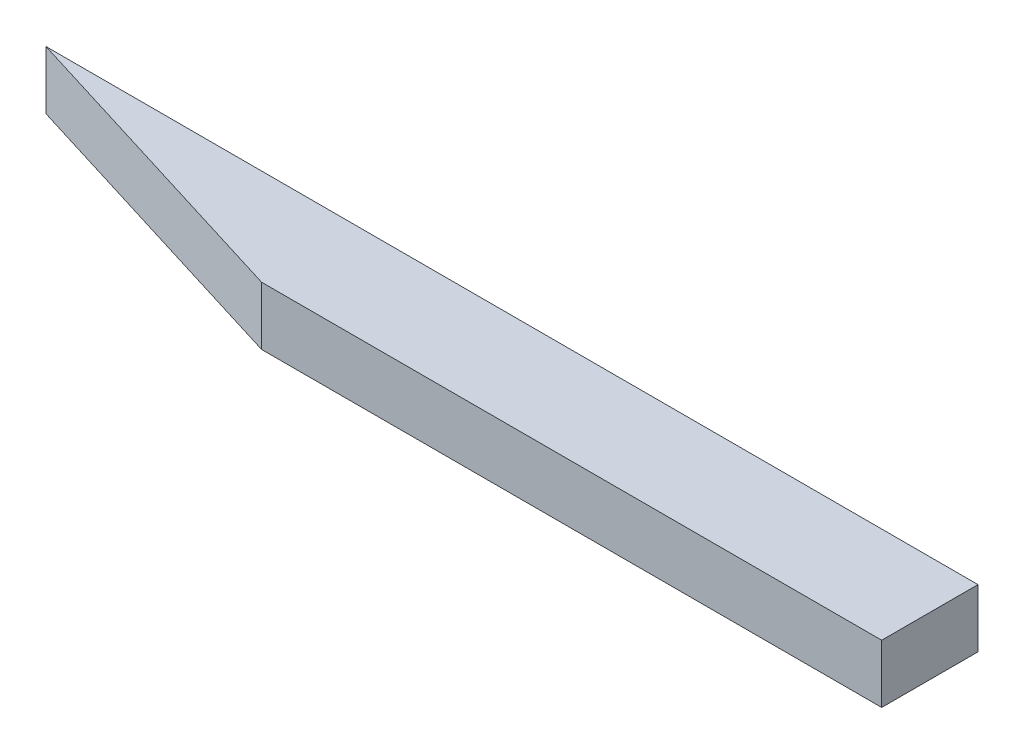
ISO-10303-21;
HEADER;
FILE_DESCRIPTION(('STEP AP214'),'2;1');
FILE_NAME('part.step','',(''),(''),'','','');
FILE_SCHEMA(('AUTOMOTIVE_DESIGN { 1 0 10303 214 1 1 1 1 }'));
ENDSEC;
DATA;
#1=APPLICATION_CONTEXT('core data for automotive mechanical design processes');
#2=APPLICATION_PROTOCOL_DEFINITION('international standard','automotive_design',2000,#1);
#3=PRODUCT_CONTEXT('',#1,'mechanical');
#4=PRODUCT('Part','Part','',(#3));
#5=PRODUCT_RELATED_PRODUCT_CATEGORY('part','',(#4));
#6=PRODUCT_DEFINITION_FORMATION('','',#4);
#7=PRODUCT_DEFINITION_CONTEXT('part definition',#1,'design');
#8=PRODUCT_DEFINITION('design','',#6,#7);
#9=PRODUCT_DEFINITION_SHAPE('','',#8);
#10=(LENGTH_UNIT() NAMED_UNIT(*) SI_UNIT(.MILLI.,.METRE.));
#11=(NAMED_UNIT(*) PLANE_ANGLE_UNIT() SI_UNIT($,.RADIAN.));
#12=(NAMED_UNIT(*) SI_UNIT($,.STERADIAN.) SOLID_ANGLE_UNIT());
#13=UNCERTAINTY_MEASURE_WITH_UNIT(LENGTH_MEASURE(1.E-05),#10,'distance_accuracy_value','');
#14=(GEOMETRIC_REPRESENTATION_CONTEXT(3) GLOBAL_UNCERTAINTY_ASSIGNED_CONTEXT((#13)) GLOBAL_UNIT_ASSIGNED_CONTEXT((#10,
#11,#12)) REPRESENTATION_CONTEXT('',''));
#15=CARTESIAN_POINT('',(0.,0.,0.));
#16=DIRECTION('',(0.,0.,1.));
#17=DIRECTION('',(1.,0.,0.));
#18=AXIS2_PLACEMENT_3D('',#15,#16,#17);
#19=CARTESIAN_POINT('',(0.,6.35,0.));
#20=DIRECTION('',(0.29507306639433,0.,-0.955474691181639));
#21=DIRECTION('',(-0.955474691181639,0.,-0.29507306639433));
#22=AXIS2_PLACEMENT_3D('',#19,#20,#21);
#23=PLANE('',#22);
#24=DIRECTION('',(0.955474691181639,0.,0.29507306639433));
#25=VECTOR('',#24,1.);
#26=CARTESIAN_POINT('',(0.,-6.35,0.));
#27=LINE('',#26,#25);
#28=CARTESIAN_POINT('',(0.,-6.35,0.));
#29=VERTEX_POINT('',#28);
#30=CARTESIAN_POINT('',(68.,-6.35,21.));
#31=VERTEX_POINT('',#30);
#32=EDGE_CURVE('E95',#29,#31,#27,.T.);
#33=ORIENTED_EDGE('',*,*,#32,.T.);
#34=DIRECTION('',(0.,-1.,0.));
#35=VECTOR('',#34,1.);
#36=CARTESIAN_POINT('',(68.,6.35,21.));
#37=LINE('',#36,#35);
#38=CARTESIAN_POINT('',(68.,6.35,21.));
#39=VERTEX_POINT('',#38);
#40=EDGE_CURVE('E11',#39,#31,#37,.T.);
#41=ORIENTED_EDGE('',*,*,#40,.F.);
#42=DIRECTION('',(0.955474691181639,0.,0.29507306639433));
#43=VECTOR('',#42,1.);
#44=CARTESIAN_POINT('',(0.,6.35,0.));
#45=LINE('',#44,#43);
#46=CARTESIAN_POINT('',(0.,6.35,0.));
#47=VERTEX_POINT('',#46);
#48=EDGE_CURVE('E83',#47,#39,#45,.T.);
#49=ORIENTED_EDGE('',*,*,#48,.F.);
#50=DIRECTION('',(0.,-1.,0.));
#51=VECTOR('',#50,1.);
#52=CARTESIAN_POINT('',(0.,6.35,0.));
#53=LINE('',#52,#51);
#54=EDGE_CURVE('E91',#47,#29,#53,.T.);
#55=ORIENTED_EDGE('',*,*,#54,.T.);
#56=EDGE_LOOP('',(#33,#41,#49,#55));
#57=FACE_BOUND('',#56,.T.);
#58=ADVANCED_FACE('F32',(#57),#23,.F.);
#59=CARTESIAN_POINT('',(68.,6.35,21.));
#60=DIRECTION('',(0.,0.,-1.));
#61=DIRECTION('',(-1.,0.,0.));
#62=AXIS2_PLACEMENT_3D('',#59,#60,#61);
#63=PLANE('',#62);
#64=DIRECTION('',(1.,0.,0.));
#65=VECTOR('',#64,1.);
#66=CARTESIAN_POINT('',(68.,-6.35,21.));
#67=LINE('',#66,#65);
#68=CARTESIAN_POINT('',(203.2,-6.35,21.0000000000009));
#69=VERTEX_POINT('',#68);
#70=EDGE_CURVE('E87',#31,#69,#67,.T.);
#71=ORIENTED_EDGE('',*,*,#70,.T.);
#72=DIRECTION('',(0.,-1.,0.));
#73=VECTOR('',#72,1.);
#74=CARTESIAN_POINT('',(203.2,6.35,21.0000000000009));
#75=LINE('',#74,#73);
#76=CARTESIAN_POINT('',(203.2,6.35,21.0000000000009));
#77=VERTEX_POINT('',#76);
#78=EDGE_CURVE('E40',#77,#69,#75,.T.);
#79=ORIENTED_EDGE('',*,*,#78,.F.);
#80=DIRECTION('',(1.,0.,0.));
#81=VECTOR('',#80,1.);
#82=CARTESIAN_POINT('',(68.,6.35,21.));
#83=LINE('',#82,#81);
#84=EDGE_CURVE('E78',#39,#77,#83,.T.);
#85=ORIENTED_EDGE('',*,*,#84,.F.);
#86=ORIENTED_EDGE('',*,*,#40,.T.);
#87=EDGE_LOOP('',(#71,#79,#85,#86));
#88=FACE_BOUND('',#87,.T.);
#89=ADVANCED_FACE('F86',(#88),#63,.F.);
#90=CARTESIAN_POINT('',(203.2,6.35,0.));
#91=DIRECTION('',(-1.,0.,0.));
#92=DIRECTION('',(0.,0.,1.));
#93=AXIS2_PLACEMENT_3D('',#90,#91,#92);
#94=PLANE('',#93);
#95=DIRECTION('',(0.,0.,-1.));
#96=VECTOR('',#95,1.);
#97=CARTESIAN_POINT('',(203.2,-6.35,0.));
#98=LINE('',#97,#96);
#99=CARTESIAN_POINT('',(203.2,-6.35,0.));
#100=VERTEX_POINT('',#99);
#101=EDGE_CURVE('E65',#69,#100,#98,.T.);
#102=ORIENTED_EDGE('',*,*,#101,.T.);
#103=DIRECTION('',(0.,-1.,0.));
#104=VECTOR('',#103,1.);
#105=CARTESIAN_POINT('',(203.2,6.35,0.));
#106=LINE('',#105,#104);
#107=CARTESIAN_POINT('',(203.2,6.35,0.));
#108=VERTEX_POINT('',#107);
#109=EDGE_CURVE('E88',#108,#100,#106,.T.);
#110=ORIENTED_EDGE('',*,*,#109,.F.);
#111=DIRECTION('',(0.,0.,-1.));
#112=VECTOR('',#111,1.);
#113=CARTESIAN_POINT('',(203.2,6.35,0.));
#114=LINE('',#113,#112);
#115=EDGE_CURVE('E81',#77,#108,#114,.T.);
#116=ORIENTED_EDGE('',*,*,#115,.F.);
#117=ORIENTED_EDGE('',*,*,#78,.T.);
#118=EDGE_LOOP('',(#102,#110,#116,#117));
#119=FACE_BOUND('',#118,.T.);
#120=ADVANCED_FACE('F89',(#119),#94,.F.);
#121=CARTESIAN_POINT('',(0.,6.35,0.));
#122=DIRECTION('',(0.,0.,1.));
#123=DIRECTION('',(1.,0.,0.));
#124=AXIS2_PLACEMENT_3D('',#121,#122,#123);
#125=PLANE('',#124);
#126=DIRECTION('',(-1.,0.,0.));
#127=VECTOR('',#126,1.);
#128=CARTESIAN_POINT('',(0.,-6.35,0.));
#129=LINE('',#128,#127);
#130=EDGE_CURVE('E71',#100,#29,#129,.T.);
#131=ORIENTED_EDGE('',*,*,#130,.T.);
#132=ORIENTED_EDGE('',*,*,#54,.F.);
#133=DIRECTION('',(-1.,0.,0.));
#134=VECTOR('',#133,1.);
#135=CARTESIAN_POINT('',(0.,6.35,0.));
#136=LINE('',#135,#134);
#137=EDGE_CURVE('E48',#108,#47,#136,.T.);
#138=ORIENTED_EDGE('',*,*,#137,.F.);
#139=ORIENTED_EDGE('',*,*,#109,.T.);
#140=EDGE_LOOP('',(#131,#132,#138,#139));
#141=FACE_BOUND('',#140,.T.);
#142=ADVANCED_FACE('F102',(#141),#125,.F.);
#143=CARTESIAN_POINT('',(203.2,6.35,62.7529411764706));
#144=DIRECTION('',(0.,-1.,0.));
#145=DIRECTION('',(0.,0.,-1.));
#146=AXIS2_PLACEMENT_3D('',#143,#144,#145);
#147=PLANE('',#146);
#148=ORIENTED_EDGE('',*,*,#48,.T.);
#149=ORIENTED_EDGE('',*,*,#84,.T.);
#150=ORIENTED_EDGE('',*,*,#115,.T.);
#151=ORIENTED_EDGE('',*,*,#137,.T.);
#152=EDGE_LOOP('',(#148,#149,#150,#151));
#153=FACE_BOUND('',#152,.T.);
#154=ADVANCED_FACE('F79',(#153),#147,.F.);
#155=CARTESIAN_POINT('',(203.2,-6.35,62.7529411764706));
#156=DIRECTION('',(0.,-1.,0.));
#157=DIRECTION('',(0.,0.,-1.));
#158=AXIS2_PLACEMENT_3D('',#155,#156,#157);
#159=PLANE('',#158);
#160=ORIENTED_EDGE('',*,*,#32,.F.);
#161=ORIENTED_EDGE('',*,*,#130,.F.);
#162=ORIENTED_EDGE('',*,*,#101,.F.);
#163=ORIENTED_EDGE('',*,*,#70,.F.);
#164=EDGE_LOOP('',(#160,#161,#162,#163));
#165=FACE_BOUND('',#164,.T.);
#166=ADVANCED_FACE('F105',(#165),#159,.T.);
#167=CLOSED_SHELL('',(#58,#89,#120,#142,#154,#166));
#168=MANIFOLD_SOLID_BREP('B2',#167);
#169=ADVANCED_BREP_SHAPE_REPRESENTATION('',(#18,#168),#14);
#170=SHAPE_DEFINITION_REPRESENTATION(#9,#169);
ENDSEC;
END-ISO-10303-21;
